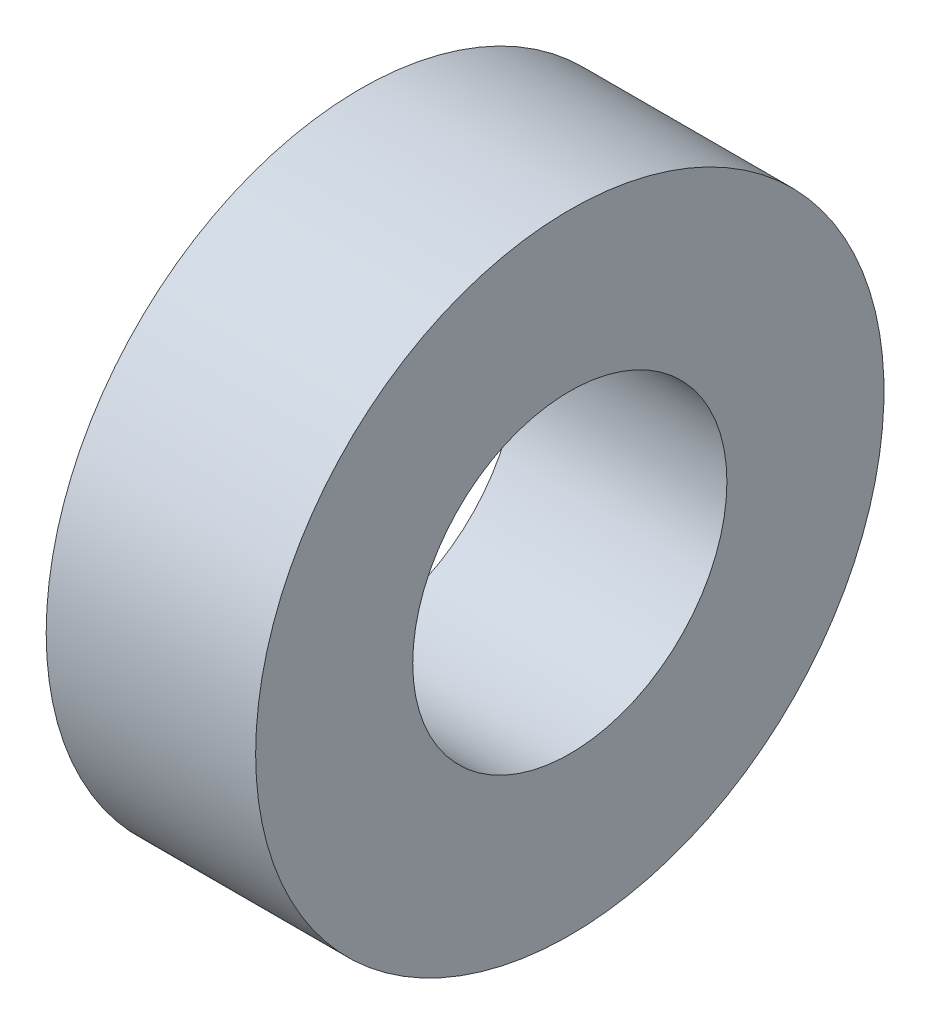
ISO-10303-21;
HEADER;
FILE_DESCRIPTION(('STEP AP214'),'2;1');
FILE_NAME('part.step','',(''),(''),'','','');
FILE_SCHEMA(('AUTOMOTIVE_DESIGN { 1 0 10303 214 1 1 1 1 }'));
ENDSEC;
DATA;
#1=APPLICATION_CONTEXT('core data for automotive mechanical design processes');
#2=APPLICATION_PROTOCOL_DEFINITION('international standard','automotive_design',2000,#1);
#3=PRODUCT_CONTEXT('',#1,'mechanical');
#4=PRODUCT('Part','Part','',(#3));
#5=PRODUCT_RELATED_PRODUCT_CATEGORY('part','',(#4));
#6=PRODUCT_DEFINITION_FORMATION('','',#4);
#7=PRODUCT_DEFINITION_CONTEXT('part definition',#1,'design');
#8=PRODUCT_DEFINITION('design','',#6,#7);
#9=PRODUCT_DEFINITION_SHAPE('','',#8);
#10=(LENGTH_UNIT() NAMED_UNIT(*) SI_UNIT(.MILLI.,.METRE.));
#11=(NAMED_UNIT(*) PLANE_ANGLE_UNIT() SI_UNIT($,.RADIAN.));
#12=(NAMED_UNIT(*) SI_UNIT($,.STERADIAN.) SOLID_ANGLE_UNIT());
#13=UNCERTAINTY_MEASURE_WITH_UNIT(LENGTH_MEASURE(1.E-05),#10,'distance_accuracy_value','');
#14=(GEOMETRIC_REPRESENTATION_CONTEXT(3) GLOBAL_UNCERTAINTY_ASSIGNED_CONTEXT((#13)) GLOBAL_UNIT_ASSIGNED_CONTEXT((#10,
#11,#12)) REPRESENTATION_CONTEXT('',''));
#15=CARTESIAN_POINT('',(0.,0.,0.));
#16=DIRECTION('',(0.,0.,1.));
#17=DIRECTION('',(1.,0.,0.));
#18=AXIS2_PLACEMENT_3D('',#15,#16,#17);
#19=CARTESIAN_POINT('',(0.,0.,0.));
#20=DIRECTION('',(-1.,0.,0.));
#21=DIRECTION('',(0.,0.,1.));
#22=AXIS2_PLACEMENT_3D('',#19,#20,#21);
#23=CYLINDRICAL_SURFACE('',#22,1.5);
#24=CARTESIAN_POINT('',(2.,0.,0.));
#25=DIRECTION('',(-1.,0.,0.));
#26=DIRECTION('',(0.,0.,1.));
#27=AXIS2_PLACEMENT_3D('',#24,#25,#26);
#28=CIRCLE('',#27,1.5);
#29=CARTESIAN_POINT('',(2.,0.,1.5));
#30=VERTEX_POINT('',#29);
#31=EDGE_CURVE('E45',#30,#30,#28,.T.);
#32=ORIENTED_EDGE('',*,*,#31,.F.);
#33=EDGE_LOOP('',(#32));
#34=FACE_BOUND('',#33,.T.);
#35=CARTESIAN_POINT('',(0.,0.,0.));
#36=DIRECTION('',(-1.,0.,0.));
#37=DIRECTION('',(0.,0.,1.));
#38=AXIS2_PLACEMENT_3D('',#35,#36,#37);
#39=CIRCLE('',#38,1.5);
#40=CARTESIAN_POINT('',(0.,0.,1.5));
#41=VERTEX_POINT('',#40);
#42=EDGE_CURVE('E10',#41,#41,#39,.T.);
#43=ORIENTED_EDGE('',*,*,#42,.T.);
#44=EDGE_LOOP('',(#43));
#45=FACE_BOUND('',#44,.T.);
#46=ADVANCED_FACE('F31',(#34,#45),#23,.F.);
#47=CARTESIAN_POINT('',(0.,1.5,0.));
#48=DIRECTION('',(1.,0.,0.));
#49=DIRECTION('',(0.,0.,-1.));
#50=AXIS2_PLACEMENT_3D('',#47,#48,#49);
#51=PLANE('',#50);
#52=ORIENTED_EDGE('',*,*,#42,.F.);
#53=EDGE_LOOP('',(#52));
#54=FACE_BOUND('',#53,.T.);
#55=CARTESIAN_POINT('',(0.,0.,0.));
#56=DIRECTION('',(-1.,0.,0.));
#57=DIRECTION('',(0.,0.,1.));
#58=AXIS2_PLACEMENT_3D('',#55,#56,#57);
#59=CIRCLE('',#58,3.);
#60=CARTESIAN_POINT('',(0.,0.,3.));
#61=VERTEX_POINT('',#60);
#62=EDGE_CURVE('E37',#61,#61,#59,.T.);
#63=ORIENTED_EDGE('',*,*,#62,.T.);
#64=EDGE_LOOP('',(#63));
#65=FACE_BOUND('',#64,.T.);
#66=ADVANCED_FACE('F54',(#54,#65),#51,.F.);
#67=CARTESIAN_POINT('',(0.,0.,0.));
#68=DIRECTION('',(-1.,0.,0.));
#69=DIRECTION('',(0.,0.,1.));
#70=AXIS2_PLACEMENT_3D('',#67,#68,#69);
#71=CYLINDRICAL_SURFACE('',#70,3.);
#72=ORIENTED_EDGE('',*,*,#62,.F.);
#73=EDGE_LOOP('',(#72));
#74=FACE_BOUND('',#73,.T.);
#75=CARTESIAN_POINT('',(2.,0.,0.));
#76=DIRECTION('',(-1.,0.,0.));
#77=DIRECTION('',(0.,0.,1.));
#78=AXIS2_PLACEMENT_3D('',#75,#76,#77);
#79=CIRCLE('',#78,3.);
#80=CARTESIAN_POINT('',(2.,0.,3.));
#81=VERTEX_POINT('',#80);
#82=EDGE_CURVE('E41',#81,#81,#79,.T.);
#83=ORIENTED_EDGE('',*,*,#82,.T.);
#84=EDGE_LOOP('',(#83));
#85=FACE_BOUND('',#84,.T.);
#86=ADVANCED_FACE('F58',(#74,#85),#71,.T.);
#87=CARTESIAN_POINT('',(2.,3.,0.));
#88=DIRECTION('',(-1.,0.,0.));
#89=DIRECTION('',(0.,0.,1.));
#90=AXIS2_PLACEMENT_3D('',#87,#88,#89);
#91=PLANE('',#90);
#92=ORIENTED_EDGE('',*,*,#82,.F.);
#93=EDGE_LOOP('',(#92));
#94=FACE_BOUND('',#93,.T.);
#95=ORIENTED_EDGE('',*,*,#31,.T.);
#96=EDGE_LOOP('',(#95));
#97=FACE_BOUND('',#96,.T.);
#98=ADVANCED_FACE('F51',(#94,#97),#91,.F.);
#99=CLOSED_SHELL('',(#46,#66,#86,#98));
#100=MANIFOLD_SOLID_BREP('B2',#99);
#101=ADVANCED_BREP_SHAPE_REPRESENTATION('',(#18,#100),#14);
#102=SHAPE_DEFINITION_REPRESENTATION(#9,#101);
ENDSEC;
END-ISO-10303-21;
